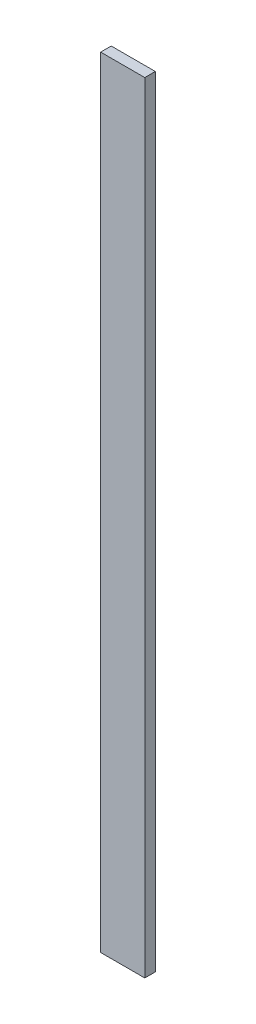
ISO-10303-21;
HEADER;
FILE_DESCRIPTION(('STEP AP214'),'2;1');
FILE_NAME('part.step','',(''),(''),'','','');
FILE_SCHEMA(('AUTOMOTIVE_DESIGN { 1 0 10303 214 1 1 1 1 }'));
ENDSEC;
DATA;
#1=APPLICATION_CONTEXT('core data for automotive mechanical design processes');
#2=APPLICATION_PROTOCOL_DEFINITION('international standard','automotive_design',2000,#1);
#3=PRODUCT_CONTEXT('',#1,'mechanical');
#4=PRODUCT('Part','Part','',(#3));
#5=PRODUCT_RELATED_PRODUCT_CATEGORY('part','',(#4));
#6=PRODUCT_DEFINITION_FORMATION('','',#4);
#7=PRODUCT_DEFINITION_CONTEXT('part definition',#1,'design');
#8=PRODUCT_DEFINITION('design','',#6,#7);
#9=PRODUCT_DEFINITION_SHAPE('','',#8);
#10=(LENGTH_UNIT() NAMED_UNIT(*) SI_UNIT(.MILLI.,.METRE.));
#11=(NAMED_UNIT(*) PLANE_ANGLE_UNIT() SI_UNIT($,.RADIAN.));
#12=(NAMED_UNIT(*) SI_UNIT($,.STERADIAN.) SOLID_ANGLE_UNIT());
#13=UNCERTAINTY_MEASURE_WITH_UNIT(LENGTH_MEASURE(1.E-05),#10,'distance_accuracy_value','');
#14=(GEOMETRIC_REPRESENTATION_CONTEXT(3) GLOBAL_UNCERTAINTY_ASSIGNED_CONTEXT((#13)) GLOBAL_UNIT_ASSIGNED_CONTEXT((#10,
#11,#12)) REPRESENTATION_CONTEXT('',''));
#15=CARTESIAN_POINT('',(0.,0.,0.));
#16=DIRECTION('',(0.,0.,1.));
#17=DIRECTION('',(1.,0.,0.));
#18=AXIS2_PLACEMENT_3D('',#15,#16,#17);
#19=CARTESIAN_POINT('',(0.,112.268,0.));
#20=DIRECTION('',(1.,0.,0.));
#21=DIRECTION('',(0.,0.,-1.));
#22=AXIS2_PLACEMENT_3D('',#19,#20,#21);
#23=PLANE('',#22);
#24=DIRECTION('',(0.,0.,1.));
#25=VECTOR('',#24,1.);
#26=CARTESIAN_POINT('',(0.,0.,0.));
#27=LINE('',#26,#25);
#28=CARTESIAN_POINT('',(0.,0.,-1.51892));
#29=VERTEX_POINT('',#28);
#30=CARTESIAN_POINT('',(0.,0.,0.));
#31=VERTEX_POINT('',#30);
#32=EDGE_CURVE('E97',#29,#31,#27,.T.);
#33=ORIENTED_EDGE('',*,*,#32,.T.);
#34=DIRECTION('',(0.,-1.,0.));
#35=VECTOR('',#34,1.);
#36=CARTESIAN_POINT('',(0.,112.268,0.));
#37=LINE('',#36,#35);
#38=CARTESIAN_POINT('',(0.,112.268,0.));
#39=VERTEX_POINT('',#38);
#40=EDGE_CURVE('E11',#39,#31,#37,.T.);
#41=ORIENTED_EDGE('',*,*,#40,.F.);
#42=DIRECTION('',(0.,0.,1.));
#43=VECTOR('',#42,1.);
#44=CARTESIAN_POINT('',(0.,112.268,0.));
#45=LINE('',#44,#43);
#46=CARTESIAN_POINT('',(0.,112.268,-1.51892));
#47=VERTEX_POINT('',#46);
#48=EDGE_CURVE('E85',#47,#39,#45,.T.);
#49=ORIENTED_EDGE('',*,*,#48,.F.);
#50=DIRECTION('',(0.,-1.,0.));
#51=VECTOR('',#50,1.);
#52=CARTESIAN_POINT('',(0.,112.268,-1.51892));
#53=LINE('',#52,#51);
#54=EDGE_CURVE('E93',#47,#29,#53,.T.);
#55=ORIENTED_EDGE('',*,*,#54,.T.);
#56=EDGE_LOOP('',(#33,#41,#49,#55));
#57=FACE_BOUND('',#56,.T.);
#58=ADVANCED_FACE('F34',(#57),#23,.F.);
#59=CARTESIAN_POINT('',(0.,112.268,0.));
#60=DIRECTION('',(0.,0.,-1.));
#61=DIRECTION('',(-1.,0.,0.));
#62=AXIS2_PLACEMENT_3D('',#59,#60,#61);
#63=PLANE('',#62);
#64=DIRECTION('',(1.,0.,0.));
#65=VECTOR('',#64,1.);
#66=CARTESIAN_POINT('',(0.,0.,0.));
#67=LINE('',#66,#65);
#68=CARTESIAN_POINT('',(6.35,0.,0.));
#69=VERTEX_POINT('',#68);
#70=EDGE_CURVE('E89',#31,#69,#67,.T.);
#71=ORIENTED_EDGE('',*,*,#70,.T.);
#72=DIRECTION('',(0.,-1.,0.));
#73=VECTOR('',#72,1.);
#74=CARTESIAN_POINT('',(6.35,112.268,0.));
#75=LINE('',#74,#73);
#76=CARTESIAN_POINT('',(6.35,112.268,0.));
#77=VERTEX_POINT('',#76);
#78=EDGE_CURVE('E42',#77,#69,#75,.T.);
#79=ORIENTED_EDGE('',*,*,#78,.F.);
#80=DIRECTION('',(1.,0.,0.));
#81=VECTOR('',#80,1.);
#82=CARTESIAN_POINT('',(0.,112.268,0.));
#83=LINE('',#82,#81);
#84=EDGE_CURVE('E80',#39,#77,#83,.T.);
#85=ORIENTED_EDGE('',*,*,#84,.F.);
#86=ORIENTED_EDGE('',*,*,#40,.T.);
#87=EDGE_LOOP('',(#71,#79,#85,#86));
#88=FACE_BOUND('',#87,.T.);
#89=ADVANCED_FACE('F88',(#88),#63,.F.);
#90=CARTESIAN_POINT('',(6.35,112.268,0.));
#91=DIRECTION('',(-1.,0.,0.));
#92=DIRECTION('',(0.,0.,1.));
#93=AXIS2_PLACEMENT_3D('',#90,#91,#92);
#94=PLANE('',#93);
#95=DIRECTION('',(0.,0.,-1.));
#96=VECTOR('',#95,1.);
#97=CARTESIAN_POINT('',(6.35,0.,0.));
#98=LINE('',#97,#96);
#99=CARTESIAN_POINT('',(6.35,0.,-1.51892));
#100=VERTEX_POINT('',#99);
#101=EDGE_CURVE('E67',#69,#100,#98,.T.);
#102=ORIENTED_EDGE('',*,*,#101,.T.);
#103=DIRECTION('',(0.,-1.,0.));
#104=VECTOR('',#103,1.);
#105=CARTESIAN_POINT('',(6.35,112.268,-1.51892));
#106=LINE('',#105,#104);
#107=CARTESIAN_POINT('',(6.35,112.268,-1.51892));
#108=VERTEX_POINT('',#107);
#109=EDGE_CURVE('E90',#108,#100,#106,.T.);
#110=ORIENTED_EDGE('',*,*,#109,.F.);
#111=DIRECTION('',(0.,0.,-1.));
#112=VECTOR('',#111,1.);
#113=CARTESIAN_POINT('',(6.35,112.268,0.));
#114=LINE('',#113,#112);
#115=EDGE_CURVE('E83',#77,#108,#114,.T.);
#116=ORIENTED_EDGE('',*,*,#115,.F.);
#117=ORIENTED_EDGE('',*,*,#78,.T.);
#118=EDGE_LOOP('',(#102,#110,#116,#117));
#119=FACE_BOUND('',#118,.T.);
#120=ADVANCED_FACE('F91',(#119),#94,.F.);
#121=CARTESIAN_POINT('',(0.,112.268,-1.51892));
#122=DIRECTION('',(0.,0.,1.));
#123=DIRECTION('',(1.,0.,0.));
#124=AXIS2_PLACEMENT_3D('',#121,#122,#123);
#125=PLANE('',#124);
#126=DIRECTION('',(-1.,0.,0.));
#127=VECTOR('',#126,1.);
#128=CARTESIAN_POINT('',(0.,0.,-1.51892));
#129=LINE('',#128,#127);
#130=EDGE_CURVE('E73',#100,#29,#129,.T.);
#131=ORIENTED_EDGE('',*,*,#130,.T.);
#132=ORIENTED_EDGE('',*,*,#54,.F.);
#133=DIRECTION('',(-1.,0.,0.));
#134=VECTOR('',#133,1.);
#135=CARTESIAN_POINT('',(0.,112.268,-1.51892));
#136=LINE('',#135,#134);
#137=EDGE_CURVE('E50',#108,#47,#136,.T.);
#138=ORIENTED_EDGE('',*,*,#137,.F.);
#139=ORIENTED_EDGE('',*,*,#109,.T.);
#140=EDGE_LOOP('',(#131,#132,#138,#139));
#141=FACE_BOUND('',#140,.T.);
#142=ADVANCED_FACE('F104',(#141),#125,.F.);
#143=CARTESIAN_POINT('',(0.,112.268,0.));
#144=DIRECTION('',(0.,-1.,0.));
#145=DIRECTION('',(0.,0.,-1.));
#146=AXIS2_PLACEMENT_3D('',#143,#144,#145);
#147=PLANE('',#146);
#148=ORIENTED_EDGE('',*,*,#48,.T.);
#149=ORIENTED_EDGE('',*,*,#84,.T.);
#150=ORIENTED_EDGE('',*,*,#115,.T.);
#151=ORIENTED_EDGE('',*,*,#137,.T.);
#152=EDGE_LOOP('',(#148,#149,#150,#151));
#153=FACE_BOUND('',#152,.T.);
#154=ADVANCED_FACE('F81',(#153),#147,.F.);
#155=CARTESIAN_POINT('',(0.,0.,0.));
#156=DIRECTION('',(0.,-1.,0.));
#157=DIRECTION('',(0.,0.,-1.));
#158=AXIS2_PLACEMENT_3D('',#155,#156,#157);
#159=PLANE('',#158);
#160=ORIENTED_EDGE('',*,*,#32,.F.);
#161=ORIENTED_EDGE('',*,*,#130,.F.);
#162=ORIENTED_EDGE('',*,*,#101,.F.);
#163=ORIENTED_EDGE('',*,*,#70,.F.);
#164=EDGE_LOOP('',(#160,#161,#162,#163));
#165=FACE_BOUND('',#164,.T.);
#166=ADVANCED_FACE('F107',(#165),#159,.T.);
#167=CLOSED_SHELL('',(#58,#89,#120,#142,#154,#166));
#168=MANIFOLD_SOLID_BREP('B2',#167);
#169=ADVANCED_BREP_SHAPE_REPRESENTATION('',(#18,#168),#14);
#170=SHAPE_DEFINITION_REPRESENTATION(#9,#169);
ENDSEC;
END-ISO-10303-21;
